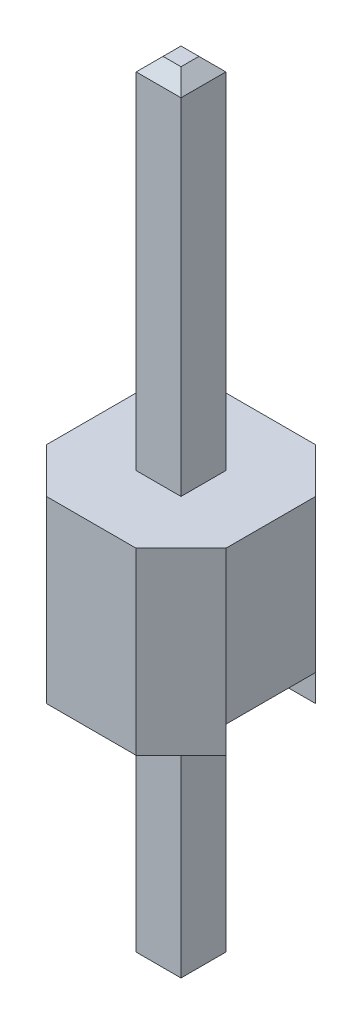
ISO-10303-21;
HEADER;
FILE_DESCRIPTION(('STEP AP214'),'2;1');
FILE_NAME('part.step','',(''),(''),'','','');
FILE_SCHEMA(('AUTOMOTIVE_DESIGN { 1 0 10303 214 1 1 1 1 }'));
ENDSEC;
DATA;
#1=APPLICATION_CONTEXT('core data for automotive mechanical design processes');
#2=APPLICATION_PROTOCOL_DEFINITION('international standard','automotive_design',2000,#1);
#3=PRODUCT_CONTEXT('',#1,'mechanical');
#4=PRODUCT('Part','Part','',(#3));
#5=PRODUCT_RELATED_PRODUCT_CATEGORY('part','',(#4));
#6=PRODUCT_DEFINITION_FORMATION('','',#4);
#7=PRODUCT_DEFINITION_CONTEXT('part definition',#1,'design');
#8=PRODUCT_DEFINITION('design','',#6,#7);
#9=PRODUCT_DEFINITION_SHAPE('','',#8);
#10=(LENGTH_UNIT() NAMED_UNIT(*) SI_UNIT(.MILLI.,.METRE.));
#11=(NAMED_UNIT(*) PLANE_ANGLE_UNIT() SI_UNIT($,.RADIAN.));
#12=(NAMED_UNIT(*) SI_UNIT($,.STERADIAN.) SOLID_ANGLE_UNIT());
#13=UNCERTAINTY_MEASURE_WITH_UNIT(LENGTH_MEASURE(1.E-05),#10,'distance_accuracy_value','');
#14=(GEOMETRIC_REPRESENTATION_CONTEXT(3) GLOBAL_UNCERTAINTY_ASSIGNED_CONTEXT((#13)) GLOBAL_UNIT_ASSIGNED_CONTEXT((#10,
#11,#12)) REPRESENTATION_CONTEXT('',''));
#15=CARTESIAN_POINT('',(0.,0.,0.));
#16=DIRECTION('',(0.,0.,1.));
#17=DIRECTION('',(1.,0.,0.));
#18=AXIS2_PLACEMENT_3D('',#15,#16,#17);
#19=CARTESIAN_POINT('',(-2.59591892663164,0.381,0.634999999999996));
#20=DIRECTION('',(0.,1.,0.));
#21=DIRECTION('',(0.,0.,1.));
#22=AXIS2_PLACEMENT_3D('',#19,#20,#21);
#23=PLANE('',#22);
#24=DIRECTION('',(0.,0.,-1.));
#25=VECTOR('',#24,1.);
#26=CARTESIAN_POINT('',(-1.27,0.381,0.635000000000008));
#27=LINE('',#26,#25);
#28=CARTESIAN_POINT('',(-1.27,0.381,0.634999999999998));
#29=VERTEX_POINT('',#28);
#30=CARTESIAN_POINT('',(-1.26999999999999,0.381,-0.635000000000004));
#31=VERTEX_POINT('',#30);
#32=EDGE_CURVE('E242',#29,#31,#27,.T.);
#33=ORIENTED_EDGE('',*,*,#32,.T.);
#34=DIRECTION('',(1.,0.,0.));
#35=VECTOR('',#34,1.);
#36=CARTESIAN_POINT('',(-2.59591892663164,0.381,-0.635000000000004));
#37=LINE('',#36,#35);
#38=CARTESIAN_POINT('',(1.27,0.381,-0.634999999999998));
#39=VERTEX_POINT('',#38);
#40=EDGE_CURVE('E250',#31,#39,#37,.T.);
#41=ORIENTED_EDGE('',*,*,#40,.T.);
#42=DIRECTION('',(0.,0.,1.));
#43=VECTOR('',#42,1.);
#44=CARTESIAN_POINT('',(1.27,0.381,0.635000000000002));
#45=LINE('',#44,#43);
#46=CARTESIAN_POINT('',(1.27,0.381,0.635000000000002));
#47=VERTEX_POINT('',#46);
#48=EDGE_CURVE('E245',#39,#47,#45,.T.);
#49=ORIENTED_EDGE('',*,*,#48,.T.);
#50=DIRECTION('',(1.,0.,0.));
#51=VECTOR('',#50,1.);
#52=CARTESIAN_POINT('',(-2.59591892663164,0.381,0.634999999999996));
#53=LINE('',#52,#51);
#54=EDGE_CURVE('E255',#29,#47,#53,.T.);
#55=ORIENTED_EDGE('',*,*,#54,.F.);
#56=EDGE_LOOP('',(#33,#41,#49,#55));
#57=FACE_BOUND('',#56,.T.);
#58=DIRECTION('',(0.,0.,1.));
#59=VECTOR('',#58,1.);
#60=CARTESIAN_POINT('',(0.3175,0.381,-0.3175));
#61=LINE('',#60,#59);
#62=CARTESIAN_POINT('',(0.3175,0.381,-0.3175));
#63=VERTEX_POINT('',#62);
#64=CARTESIAN_POINT('',(0.3175,0.381,0.3175));
#65=VERTEX_POINT('',#64);
#66=EDGE_CURVE('E187',#63,#65,#61,.T.);
#67=ORIENTED_EDGE('',*,*,#66,.F.);
#68=DIRECTION('',(1.,0.,0.));
#69=VECTOR('',#68,1.);
#70=CARTESIAN_POINT('',(-0.3175,0.381,-0.3175));
#71=LINE('',#70,#69);
#72=CARTESIAN_POINT('',(-0.3175,0.381,-0.3175));
#73=VERTEX_POINT('',#72);
#74=EDGE_CURVE('E192',#73,#63,#71,.T.);
#75=ORIENTED_EDGE('',*,*,#74,.F.);
#76=DIRECTION('',(0.,0.,-1.));
#77=VECTOR('',#76,1.);
#78=CARTESIAN_POINT('',(-0.3175,0.381,-0.3175));
#79=LINE('',#78,#77);
#80=CARTESIAN_POINT('',(-0.3175,0.381,0.3175));
#81=VERTEX_POINT('',#80);
#82=EDGE_CURVE('E204',#81,#73,#79,.T.);
#83=ORIENTED_EDGE('',*,*,#82,.F.);
#84=DIRECTION('',(-1.,0.,0.));
#85=VECTOR('',#84,1.);
#86=CARTESIAN_POINT('',(-0.3175,0.381,0.3175));
#87=LINE('',#86,#85);
#88=EDGE_CURVE('E200',#65,#81,#87,.T.);
#89=ORIENTED_EDGE('',*,*,#88,.F.);
#90=EDGE_LOOP('',(#67,#75,#83,#89));
#91=FACE_BOUND('',#90,.T.);
#92=ADVANCED_FACE('F37',(#57,#91),#23,.F.);
#93=CARTESIAN_POINT('',(0.,2.54,0.));
#94=DIRECTION('',(0.,1.,0.));
#95=DIRECTION('',(0.,0.,1.));
#96=AXIS2_PLACEMENT_3D('',#93,#94,#95);
#97=PLANE('',#96);
#98=DIRECTION('',(-1.,0.,0.));
#99=VECTOR('',#98,1.);
#100=CARTESIAN_POINT('',(-0.634999999999986,2.54,-1.27000000000001));
#101=LINE('',#100,#99);
#102=CARTESIAN_POINT('',(0.634999999999999,2.54,-1.27));
#103=VERTEX_POINT('',#102);
#104=CARTESIAN_POINT('',(-0.634999999999986,2.54,-1.27000000000001));
#105=VERTEX_POINT('',#104);
#106=EDGE_CURVE('E260',#103,#105,#101,.T.);
#107=ORIENTED_EDGE('',*,*,#106,.T.);
#108=DIRECTION('',(-0.707106781186555,0.,0.70710678118654));
#109=VECTOR('',#108,1.);
#110=CARTESIAN_POINT('',(-1.26999999999999,2.54,-0.635000000000013));
#111=LINE('',#110,#109);
#112=CARTESIAN_POINT('',(-1.26999999999999,2.54,-0.635000000000013));
#113=VERTEX_POINT('',#112);
#114=EDGE_CURVE('E263',#105,#113,#111,.T.);
#115=ORIENTED_EDGE('',*,*,#114,.T.);
#116=DIRECTION('',(0.,0.,1.));
#117=VECTOR('',#116,1.);
#118=CARTESIAN_POINT('',(-1.27,2.54,0.63499999999999));
#119=LINE('',#118,#117);
#120=CARTESIAN_POINT('',(-1.27,2.54,0.63499999999999));
#121=VERTEX_POINT('',#120);
#122=EDGE_CURVE('E266',#113,#121,#119,.T.);
#123=ORIENTED_EDGE('',*,*,#122,.T.);
#124=DIRECTION('',(0.707106781186542,0.,0.707106781186553));
#125=VECTOR('',#124,1.);
#126=CARTESIAN_POINT('',(-0.635000000000008,2.54,1.27));
#127=LINE('',#126,#125);
#128=CARTESIAN_POINT('',(-0.635000000000008,2.54,1.27));
#129=VERTEX_POINT('',#128);
#130=EDGE_CURVE('E268',#121,#129,#127,.T.);
#131=ORIENTED_EDGE('',*,*,#130,.T.);
#132=DIRECTION('',(1.,0.,0.));
#133=VECTOR('',#132,1.);
#134=CARTESIAN_POINT('',(-0.635000000000008,2.54,1.27));
#135=LINE('',#134,#133);
#136=CARTESIAN_POINT('',(0.634999999999995,2.54,1.27));
#137=VERTEX_POINT('',#136);
#138=EDGE_CURVE('E270',#129,#137,#135,.T.);
#139=ORIENTED_EDGE('',*,*,#138,.T.);
#140=DIRECTION('',(0.70710678118655,0.,-0.707106781186545));
#141=VECTOR('',#140,1.);
#142=CARTESIAN_POINT('',(1.27,2.54,0.635000000000004));
#143=LINE('',#142,#141);
#144=CARTESIAN_POINT('',(1.27,2.54,0.635000000000004));
#145=VERTEX_POINT('',#144);
#146=EDGE_CURVE('E272',#137,#145,#143,.T.);
#147=ORIENTED_EDGE('',*,*,#146,.T.);
#148=DIRECTION('',(0.,0.,-1.));
#149=VECTOR('',#148,1.);
#150=CARTESIAN_POINT('',(1.27,2.54,0.635000000000004));
#151=LINE('',#150,#149);
#152=CARTESIAN_POINT('',(1.27,2.54,-0.634999999999999));
#153=VERTEX_POINT('',#152);
#154=EDGE_CURVE('E274',#145,#153,#151,.T.);
#155=ORIENTED_EDGE('',*,*,#154,.T.);
#156=DIRECTION('',(-0.707106781186548,0.,-0.707106781186548));
#157=VECTOR('',#156,1.);
#158=CARTESIAN_POINT('',(0.634999999999999,2.54,-1.27));
#159=LINE('',#158,#157);
#160=EDGE_CURVE('E276',#153,#103,#159,.T.);
#161=ORIENTED_EDGE('',*,*,#160,.T.);
#162=EDGE_LOOP('',(#107,#115,#123,#131,#139,#147,#155,#161));
#163=FACE_BOUND('',#162,.T.);
#164=DIRECTION('',(-1.,0.,0.));
#165=VECTOR('',#164,1.);
#166=CARTESIAN_POINT('',(-0.3175,2.54,-0.3175));
#167=LINE('',#166,#165);
#168=CARTESIAN_POINT('',(0.3175,2.54,-0.3175));
#169=VERTEX_POINT('',#168);
#170=CARTESIAN_POINT('',(-0.3175,2.54,-0.3175));
#171=VERTEX_POINT('',#170);
#172=EDGE_CURVE('E218',#169,#171,#167,.T.);
#173=ORIENTED_EDGE('',*,*,#172,.F.);
#174=DIRECTION('',(0.,0.,-1.));
#175=VECTOR('',#174,1.);
#176=CARTESIAN_POINT('',(0.3175,2.54,0.3175));
#177=LINE('',#176,#175);
#178=CARTESIAN_POINT('',(0.3175,2.54,0.3175));
#179=VERTEX_POINT('',#178);
#180=EDGE_CURVE('E215',#179,#169,#177,.T.);
#181=ORIENTED_EDGE('',*,*,#180,.F.);
#182=DIRECTION('',(1.,0.,0.));
#183=VECTOR('',#182,1.);
#184=CARTESIAN_POINT('',(-0.3175,2.54,0.3175));
#185=LINE('',#184,#183);
#186=CARTESIAN_POINT('',(-0.3175,2.54,0.3175));
#187=VERTEX_POINT('',#186);
#188=EDGE_CURVE('E225',#187,#179,#185,.T.);
#189=ORIENTED_EDGE('',*,*,#188,.F.);
#190=DIRECTION('',(0.,0.,1.));
#191=VECTOR('',#190,1.);
#192=CARTESIAN_POINT('',(-0.3175,2.54,0.3175));
#193=LINE('',#192,#191);
#194=EDGE_CURVE('E222',#171,#187,#193,.T.);
#195=ORIENTED_EDGE('',*,*,#194,.F.);
#196=EDGE_LOOP('',(#173,#181,#189,#195));
#197=FACE_BOUND('',#196,.T.);
#198=ADVANCED_FACE('F390',(#163,#197),#97,.T.);
#199=CARTESIAN_POINT('',(0.,0.,0.));
#200=DIRECTION('',(0.,1.,0.));
#201=DIRECTION('',(0.,0.,1.));
#202=AXIS2_PLACEMENT_3D('',#199,#200,#201);
#203=PLANE('',#202);
#204=DIRECTION('',(-0.707106781186548,0.,-0.707106781186548));
#205=VECTOR('',#204,1.);
#206=CARTESIAN_POINT('',(0.634999999999999,0.,-1.27));
#207=LINE('',#206,#205);
#208=CARTESIAN_POINT('',(1.27,0.,-0.634999999999999));
#209=VERTEX_POINT('',#208);
#210=CARTESIAN_POINT('',(0.634999999999999,0.,-1.27));
#211=VERTEX_POINT('',#210);
#212=EDGE_CURVE('E264',#209,#211,#207,.T.);
#213=ORIENTED_EDGE('',*,*,#212,.F.);
#214=DIRECTION('',(1.,0.,0.));
#215=VECTOR('',#214,1.);
#216=CARTESIAN_POINT('',(-2.59591892663164,0.,-0.635000000000005));
#217=LINE('',#216,#215);
#218=CARTESIAN_POINT('',(-1.26999999999999,0.,-0.635000000000006));
#219=VERTEX_POINT('',#218);
#220=EDGE_CURVE('E240',#219,#209,#217,.T.);
#221=ORIENTED_EDGE('',*,*,#220,.F.);
#222=DIRECTION('',(-0.707106781186555,0.,0.70710678118654));
#223=VECTOR('',#222,1.);
#224=CARTESIAN_POINT('',(-1.26999999999999,0.,-0.635000000000013));
#225=LINE('',#224,#223);
#226=CARTESIAN_POINT('',(-0.634999999999986,0.,-1.27000000000001));
#227=VERTEX_POINT('',#226);
#228=EDGE_CURVE('E281',#227,#219,#225,.T.);
#229=ORIENTED_EDGE('',*,*,#228,.F.);
#230=DIRECTION('',(-1.,0.,0.));
#231=VECTOR('',#230,1.);
#232=CARTESIAN_POINT('',(-0.634999999999986,0.,-1.27000000000001));
#233=LINE('',#232,#231);
#234=EDGE_CURVE('E259',#211,#227,#233,.T.);
#235=ORIENTED_EDGE('',*,*,#234,.F.);
#236=EDGE_LOOP('',(#213,#221,#229,#235));
#237=FACE_BOUND('',#236,.T.);
#238=ADVANCED_FACE('F396',(#237),#203,.F.);
#239=CARTESIAN_POINT('',(-0.634999999999986,2.54,-1.27000000000001));
#240=DIRECTION('',(0.,0.,1.));
#241=DIRECTION('',(1.,0.,0.));
#242=AXIS2_PLACEMENT_3D('',#239,#240,#241);
#243=PLANE('',#242);
#244=ORIENTED_EDGE('',*,*,#234,.T.);
#245=DIRECTION('',(0.,-1.,0.));
#246=VECTOR('',#245,1.);
#247=CARTESIAN_POINT('',(-0.634999999999986,2.54,-1.27000000000001));
#248=LINE('',#247,#246);
#249=EDGE_CURVE('E312',#105,#227,#248,.T.);
#250=ORIENTED_EDGE('',*,*,#249,.F.);
#251=ORIENTED_EDGE('',*,*,#106,.F.);
#252=DIRECTION('',(0.,-1.,0.));
#253=VECTOR('',#252,1.);
#254=CARTESIAN_POINT('',(0.634999999999999,2.54,-1.27));
#255=LINE('',#254,#253);
#256=EDGE_CURVE('E278',#103,#211,#255,.T.);
#257=ORIENTED_EDGE('',*,*,#256,.T.);
#258=EDGE_LOOP('',(#244,#250,#251,#257));
#259=FACE_BOUND('',#258,.T.);
#260=ADVANCED_FACE('F438',(#259),#243,.F.);
#261=CARTESIAN_POINT('',(-1.26999999999999,2.54,-0.635000000000013));
#262=DIRECTION('',(0.70710678118654,0.,0.707106781186555));
#263=DIRECTION('',(0.707106781186555,0.,-0.70710678118654));
#264=AXIS2_PLACEMENT_3D('',#261,#262,#263);
#265=PLANE('',#264);
#266=ORIENTED_EDGE('',*,*,#228,.T.);
#267=DIRECTION('',(0.,-1.,0.));
#268=VECTOR('',#267,1.);
#269=CARTESIAN_POINT('',(-1.26999999999999,0.,-0.635000000000003));
#270=LINE('',#269,#268);
#271=EDGE_CURVE('E239',#31,#219,#270,.T.);
#272=ORIENTED_EDGE('',*,*,#271,.F.);
#273=DIRECTION('',(0.,-1.,0.));
#274=VECTOR('',#273,1.);
#275=CARTESIAN_POINT('',(-1.26999999999999,2.54,-0.635000000000013));
#276=LINE('',#275,#274);
#277=EDGE_CURVE('E309',#113,#31,#276,.T.);
#278=ORIENTED_EDGE('',*,*,#277,.F.);
#279=ORIENTED_EDGE('',*,*,#114,.F.);
#280=ORIENTED_EDGE('',*,*,#249,.T.);
#281=EDGE_LOOP('',(#266,#272,#278,#279,#280));
#282=FACE_BOUND('',#281,.T.);
#283=ADVANCED_FACE('F434',(#282),#265,.F.);
#284=CARTESIAN_POINT('',(-1.27,2.54,0.63499999999999));
#285=DIRECTION('',(1.,0.,0.));
#286=DIRECTION('',(0.,0.,-1.));
#287=AXIS2_PLACEMENT_3D('',#284,#285,#286);
#288=PLANE('',#287);
#289=ORIENTED_EDGE('',*,*,#277,.T.);
#290=ORIENTED_EDGE('',*,*,#32,.F.);
#291=DIRECTION('',(0.,-1.,0.));
#292=VECTOR('',#291,1.);
#293=CARTESIAN_POINT('',(-1.27,2.54,0.63499999999999));
#294=LINE('',#293,#292);
#295=EDGE_CURVE('E306',#121,#29,#294,.T.);
#296=ORIENTED_EDGE('',*,*,#295,.F.);
#297=ORIENTED_EDGE('',*,*,#122,.F.);
#298=EDGE_LOOP('',(#289,#290,#296,#297));
#299=FACE_BOUND('',#298,.T.);
#300=ADVANCED_FACE('F430',(#299),#288,.F.);
#301=CARTESIAN_POINT('',(-0.635000000000008,2.54,1.27));
#302=DIRECTION('',(0.707106781186553,0.,-0.707106781186542));
#303=DIRECTION('',(-0.707106781186542,0.,-0.707106781186553));
#304=AXIS2_PLACEMENT_3D('',#301,#302,#303);
#305=PLANE('',#304);
#306=DIRECTION('',(0.707106781186542,0.,0.707106781186553));
#307=VECTOR('',#306,1.);
#308=CARTESIAN_POINT('',(-0.635000000000008,0.,1.27));
#309=LINE('',#308,#307);
#310=CARTESIAN_POINT('',(-1.27,0.,0.635));
#311=VERTEX_POINT('',#310);
#312=CARTESIAN_POINT('',(-0.635000000000008,0.,1.27));
#313=VERTEX_POINT('',#312);
#314=EDGE_CURVE('E284',#311,#313,#309,.T.);
#315=ORIENTED_EDGE('',*,*,#314,.T.);
#316=DIRECTION('',(0.,-1.,0.));
#317=VECTOR('',#316,1.);
#318=CARTESIAN_POINT('',(-0.635000000000008,2.54,1.27));
#319=LINE('',#318,#317);
#320=EDGE_CURVE('E303',#129,#313,#319,.T.);
#321=ORIENTED_EDGE('',*,*,#320,.F.);
#322=ORIENTED_EDGE('',*,*,#130,.F.);
#323=ORIENTED_EDGE('',*,*,#295,.T.);
#324=DIRECTION('',(0.,1.,0.));
#325=VECTOR('',#324,1.);
#326=CARTESIAN_POINT('',(-1.27,0.,0.635));
#327=LINE('',#326,#325);
#328=EDGE_CURVE('E237',#311,#29,#327,.T.);
#329=ORIENTED_EDGE('',*,*,#328,.F.);
#330=EDGE_LOOP('',(#315,#321,#322,#323,#329));
#331=FACE_BOUND('',#330,.T.);
#332=ADVANCED_FACE('F426',(#331),#305,.F.);
#333=CARTESIAN_POINT('',(-0.635000000000008,2.54,1.27));
#334=DIRECTION('',(0.,0.,-1.));
#335=DIRECTION('',(-1.,0.,0.));
#336=AXIS2_PLACEMENT_3D('',#333,#334,#335);
#337=PLANE('',#336);
#338=DIRECTION('',(1.,0.,0.));
#339=VECTOR('',#338,1.);
#340=CARTESIAN_POINT('',(-0.635000000000008,0.,1.27));
#341=LINE('',#340,#339);
#342=CARTESIAN_POINT('',(0.634999999999995,0.,1.27));
#343=VERTEX_POINT('',#342);
#344=EDGE_CURVE('E286',#313,#343,#341,.T.);
#345=ORIENTED_EDGE('',*,*,#344,.T.);
#346=DIRECTION('',(0.,-1.,0.));
#347=VECTOR('',#346,1.);
#348=CARTESIAN_POINT('',(0.634999999999995,2.54,1.27));
#349=LINE('',#348,#347);
#350=EDGE_CURVE('E300',#137,#343,#349,.T.);
#351=ORIENTED_EDGE('',*,*,#350,.F.);
#352=ORIENTED_EDGE('',*,*,#138,.F.);
#353=ORIENTED_EDGE('',*,*,#320,.T.);
#354=EDGE_LOOP('',(#345,#351,#352,#353));
#355=FACE_BOUND('',#354,.T.);
#356=ADVANCED_FACE('F422',(#355),#337,.F.);
#357=CARTESIAN_POINT('',(1.27,2.54,0.635000000000004));
#358=DIRECTION('',(-0.707106781186545,0.,-0.70710678118655));
#359=DIRECTION('',(-0.70710678118655,0.,0.707106781186545));
#360=AXIS2_PLACEMENT_3D('',#357,#358,#359);
#361=PLANE('',#360);
#362=DIRECTION('',(0.70710678118655,0.,-0.707106781186545));
#363=VECTOR('',#362,1.);
#364=CARTESIAN_POINT('',(1.27,0.,0.635000000000004));
#365=LINE('',#364,#363);
#366=CARTESIAN_POINT('',(1.27,0.,0.635000000000004));
#367=VERTEX_POINT('',#366);
#368=EDGE_CURVE('E288',#343,#367,#365,.T.);
#369=ORIENTED_EDGE('',*,*,#368,.T.);
#370=DIRECTION('',(0.,-1.,0.));
#371=VECTOR('',#370,1.);
#372=CARTESIAN_POINT('',(1.27,0.,0.635000000000004));
#373=LINE('',#372,#371);
#374=EDGE_CURVE('E248',#47,#367,#373,.T.);
#375=ORIENTED_EDGE('',*,*,#374,.F.);
#376=DIRECTION('',(0.,-1.,0.));
#377=VECTOR('',#376,1.);
#378=CARTESIAN_POINT('',(1.27,2.54,0.635000000000004));
#379=LINE('',#378,#377);
#380=EDGE_CURVE('E297',#145,#47,#379,.T.);
#381=ORIENTED_EDGE('',*,*,#380,.F.);
#382=ORIENTED_EDGE('',*,*,#146,.F.);
#383=ORIENTED_EDGE('',*,*,#350,.T.);
#384=EDGE_LOOP('',(#369,#375,#381,#382,#383));
#385=FACE_BOUND('',#384,.T.);
#386=ADVANCED_FACE('F418',(#385),#361,.F.);
#387=CARTESIAN_POINT('',(1.27,2.54,0.635000000000004));
#388=DIRECTION('',(-1.,0.,0.));
#389=DIRECTION('',(0.,0.,1.));
#390=AXIS2_PLACEMENT_3D('',#387,#388,#389);
#391=PLANE('',#390);
#392=ORIENTED_EDGE('',*,*,#380,.T.);
#393=ORIENTED_EDGE('',*,*,#48,.F.);
#394=DIRECTION('',(0.,-1.,0.));
#395=VECTOR('',#394,1.);
#396=CARTESIAN_POINT('',(1.27,2.54,-0.634999999999999));
#397=LINE('',#396,#395);
#398=EDGE_CURVE('E294',#153,#39,#397,.T.);
#399=ORIENTED_EDGE('',*,*,#398,.F.);
#400=ORIENTED_EDGE('',*,*,#154,.F.);
#401=EDGE_LOOP('',(#392,#393,#399,#400));
#402=FACE_BOUND('',#401,.T.);
#403=ADVANCED_FACE('F414',(#402),#391,.F.);
#404=CARTESIAN_POINT('',(0.634999999999999,2.54,-1.27));
#405=DIRECTION('',(-0.707106781186548,0.,0.707106781186548));
#406=DIRECTION('',(0.707106781186548,0.,0.707106781186548));
#407=AXIS2_PLACEMENT_3D('',#404,#405,#406);
#408=PLANE('',#407);
#409=ORIENTED_EDGE('',*,*,#212,.T.);
#410=ORIENTED_EDGE('',*,*,#256,.F.);
#411=ORIENTED_EDGE('',*,*,#160,.F.);
#412=ORIENTED_EDGE('',*,*,#398,.T.);
#413=DIRECTION('',(0.,1.,0.));
#414=VECTOR('',#413,1.);
#415=CARTESIAN_POINT('',(1.27,0.,-0.634999999999999));
#416=LINE('',#415,#414);
#417=EDGE_CURVE('E236',#209,#39,#416,.T.);
#418=ORIENTED_EDGE('',*,*,#417,.F.);
#419=EDGE_LOOP('',(#409,#410,#411,#412,#418));
#420=FACE_BOUND('',#419,.T.);
#421=ADVANCED_FACE('F410',(#420),#408,.F.);
#422=ORIENTED_EDGE('',*,*,#314,.F.);
#423=DIRECTION('',(1.,0.,0.));
#424=VECTOR('',#423,1.);
#425=CARTESIAN_POINT('',(-2.59591892663164,0.,0.634999999999998));
#426=LINE('',#425,#424);
#427=EDGE_CURVE('E252',#311,#367,#426,.T.);
#428=ORIENTED_EDGE('',*,*,#427,.T.);
#429=ORIENTED_EDGE('',*,*,#368,.F.);
#430=ORIENTED_EDGE('',*,*,#344,.F.);
#431=EDGE_LOOP('',(#422,#428,#429,#430));
#432=FACE_BOUND('',#431,.T.);
#433=ADVANCED_FACE('F405',(#432),#203,.F.);
#434=CARTESIAN_POINT('',(-2.59591892663164,0.,-0.635000000000005));
#435=DIRECTION('',(0.,0.,-1.));
#436=DIRECTION('',(0.,1.,0.));
#437=AXIS2_PLACEMENT_3D('',#434,#435,#436);
#438=PLANE('',#437);
#439=ORIENTED_EDGE('',*,*,#271,.T.);
#440=ORIENTED_EDGE('',*,*,#220,.T.);
#441=ORIENTED_EDGE('',*,*,#417,.T.);
#442=ORIENTED_EDGE('',*,*,#40,.F.);
#443=EDGE_LOOP('',(#439,#440,#441,#442));
#444=FACE_BOUND('',#443,.T.);
#445=ADVANCED_FACE('F403',(#444),#438,.F.);
#446=CARTESIAN_POINT('',(-2.59591892663164,0.,0.634999999999998));
#447=DIRECTION('',(0.,0.,1.));
#448=DIRECTION('',(0.,-1.,0.));
#449=AXIS2_PLACEMENT_3D('',#446,#447,#448);
#450=PLANE('',#449);
#451=ORIENTED_EDGE('',*,*,#328,.T.);
#452=ORIENTED_EDGE('',*,*,#54,.T.);
#453=ORIENTED_EDGE('',*,*,#374,.T.);
#454=ORIENTED_EDGE('',*,*,#427,.F.);
#455=EDGE_LOOP('',(#451,#452,#453,#454));
#456=FACE_BOUND('',#455,.T.);
#457=ADVANCED_FACE('F401',(#456),#450,.F.);
#458=CARTESIAN_POINT('',(0.3175,7.62,0.3175));
#459=DIRECTION('',(-1.,0.,0.));
#460=DIRECTION('',(0.,0.,1.));
#461=AXIS2_PLACEMENT_3D('',#458,#459,#460);
#462=PLANE('',#461);
#463=DIRECTION('',(0.,-1.,0.));
#464=VECTOR('',#463,1.);
#465=CARTESIAN_POINT('',(0.3175,7.62,-0.3175));
#466=LINE('',#465,#464);
#467=CARTESIAN_POINT('',(0.3175,7.4295,-0.3175));
#468=VERTEX_POINT('',#467);
#469=EDGE_CURVE('E234',#468,#169,#466,.T.);
#470=ORIENTED_EDGE('',*,*,#469,.F.);
#471=DIRECTION('',(0.,0.,1.));
#472=VECTOR('',#471,1.);
#473=CARTESIAN_POINT('',(0.3175,7.4295,0.3175));
#474=LINE('',#473,#472);
#475=CARTESIAN_POINT('',(0.3175,7.4295,0.3175));
#476=VERTEX_POINT('',#475);
#477=EDGE_CURVE('E327',#468,#476,#474,.T.);
#478=ORIENTED_EDGE('',*,*,#477,.T.);
#479=DIRECTION('',(0.,-1.,0.));
#480=VECTOR('',#479,1.);
#481=CARTESIAN_POINT('',(0.3175,7.62,0.3175));
#482=LINE('',#481,#480);
#483=EDGE_CURVE('E228',#476,#179,#482,.T.);
#484=ORIENTED_EDGE('',*,*,#483,.T.);
#485=ORIENTED_EDGE('',*,*,#180,.T.);
#486=EDGE_LOOP('',(#470,#478,#484,#485));
#487=FACE_BOUND('',#486,.T.);
#488=ADVANCED_FACE('F527',(#487),#462,.F.);
#489=CARTESIAN_POINT('',(-0.3175,7.62,-0.3175));
#490=DIRECTION('',(0.,0.,1.));
#491=DIRECTION('',(1.,0.,0.));
#492=AXIS2_PLACEMENT_3D('',#489,#490,#491);
#493=PLANE('',#492);
#494=DIRECTION('',(0.,-1.,0.));
#495=VECTOR('',#494,1.);
#496=CARTESIAN_POINT('',(-0.3175,7.62,-0.3175));
#497=LINE('',#496,#495);
#498=CARTESIAN_POINT('',(-0.3175,7.4295,-0.3175));
#499=VERTEX_POINT('',#498);
#500=EDGE_CURVE('E232',#499,#171,#497,.T.);
#501=ORIENTED_EDGE('',*,*,#500,.F.);
#502=DIRECTION('',(1.,0.,0.));
#503=VECTOR('',#502,1.);
#504=CARTESIAN_POINT('',(-0.3175,7.4295,-0.3175));
#505=LINE('',#504,#503);
#506=EDGE_CURVE('E324',#499,#468,#505,.T.);
#507=ORIENTED_EDGE('',*,*,#506,.T.);
#508=ORIENTED_EDGE('',*,*,#469,.T.);
#509=ORIENTED_EDGE('',*,*,#172,.T.);
#510=EDGE_LOOP('',(#501,#507,#508,#509));
#511=FACE_BOUND('',#510,.T.);
#512=ADVANCED_FACE('F515',(#511),#493,.F.);
#513=CARTESIAN_POINT('',(-0.3175,7.62,0.3175));
#514=DIRECTION('',(1.,0.,0.));
#515=DIRECTION('',(0.,0.,-1.));
#516=AXIS2_PLACEMENT_3D('',#513,#514,#515);
#517=PLANE('',#516);
#518=DIRECTION('',(0.,-1.,0.));
#519=VECTOR('',#518,1.);
#520=CARTESIAN_POINT('',(-0.3175,7.62,0.3175));
#521=LINE('',#520,#519);
#522=CARTESIAN_POINT('',(-0.3175,7.4295,0.3175));
#523=VERTEX_POINT('',#522);
#524=EDGE_CURVE('E230',#523,#187,#521,.T.);
#525=ORIENTED_EDGE('',*,*,#524,.F.);
#526=DIRECTION('',(0.,0.,-1.));
#527=VECTOR('',#526,1.);
#528=CARTESIAN_POINT('',(-0.3175,7.4295,0.3175));
#529=LINE('',#528,#527);
#530=EDGE_CURVE('E329',#523,#499,#529,.T.);
#531=ORIENTED_EDGE('',*,*,#530,.T.);
#532=ORIENTED_EDGE('',*,*,#500,.T.);
#533=ORIENTED_EDGE('',*,*,#194,.T.);
#534=EDGE_LOOP('',(#525,#531,#532,#533));
#535=FACE_BOUND('',#534,.T.);
#536=ADVANCED_FACE('F509',(#535),#517,.F.);
#537=CARTESIAN_POINT('',(-0.3175,7.62,0.3175));
#538=DIRECTION('',(0.,0.,-1.));
#539=DIRECTION('',(-1.,0.,0.));
#540=AXIS2_PLACEMENT_3D('',#537,#538,#539);
#541=PLANE('',#540);
#542=ORIENTED_EDGE('',*,*,#483,.F.);
#543=DIRECTION('',(-1.,0.,0.));
#544=VECTOR('',#543,1.);
#545=CARTESIAN_POINT('',(-0.3175,7.4295,0.3175));
#546=LINE('',#545,#544);
#547=EDGE_CURVE('E331',#476,#523,#546,.T.);
#548=ORIENTED_EDGE('',*,*,#547,.T.);
#549=ORIENTED_EDGE('',*,*,#524,.T.);
#550=ORIENTED_EDGE('',*,*,#188,.T.);
#551=EDGE_LOOP('',(#542,#548,#549,#550));
#552=FACE_BOUND('',#551,.T.);
#553=ADVANCED_FACE('F514',(#552),#541,.F.);
#554=CARTESIAN_POINT('',(0.,7.62,0.));
#555=DIRECTION('',(0.,-1.,0.));
#556=DIRECTION('',(0.,0.,-1.));
#557=AXIS2_PLACEMENT_3D('',#554,#555,#556);
#558=PLANE('',#557);
#559=DIRECTION('',(0.,0.,-1.));
#560=VECTOR('',#559,1.);
#561=CARTESIAN_POINT('',(0.127000000000001,7.62,0.));
#562=LINE('',#561,#560);
#563=CARTESIAN_POINT('',(0.127000000000001,7.62,0.127000000000001));
#564=VERTEX_POINT('',#563);
#565=CARTESIAN_POINT('',(0.127000000000001,7.62,-0.127000000000001));
#566=VERTEX_POINT('',#565);
#567=EDGE_CURVE('E319',#564,#566,#562,.T.);
#568=ORIENTED_EDGE('',*,*,#567,.T.);
#569=DIRECTION('',(-1.,0.,0.));
#570=VECTOR('',#569,1.);
#571=CARTESIAN_POINT('',(0.,7.62,-0.127000000000001));
#572=LINE('',#571,#570);
#573=CARTESIAN_POINT('',(-0.127000000000001,7.62,-0.127000000000001));
#574=VERTEX_POINT('',#573);
#575=EDGE_CURVE('E321',#566,#574,#572,.T.);
#576=ORIENTED_EDGE('',*,*,#575,.T.);
#577=DIRECTION('',(0.,0.,1.));
#578=VECTOR('',#577,1.);
#579=CARTESIAN_POINT('',(-0.127000000000001,7.62,0.));
#580=LINE('',#579,#578);
#581=CARTESIAN_POINT('',(-0.127000000000001,7.62,0.127000000000001));
#582=VERTEX_POINT('',#581);
#583=EDGE_CURVE('E317',#574,#582,#580,.T.);
#584=ORIENTED_EDGE('',*,*,#583,.T.);
#585=DIRECTION('',(1.,0.,0.));
#586=VECTOR('',#585,1.);
#587=CARTESIAN_POINT('',(0.,7.62,0.127000000000001));
#588=LINE('',#587,#586);
#589=EDGE_CURVE('E315',#582,#564,#588,.T.);
#590=ORIENTED_EDGE('',*,*,#589,.T.);
#591=EDGE_LOOP('',(#568,#576,#584,#590));
#592=FACE_BOUND('',#591,.T.);
#593=ADVANCED_FACE('F458',(#592),#558,.F.);
#594=CARTESIAN_POINT('',(0.,7.62,0.127000000000001));
#595=DIRECTION('',(0.,-0.707106781186546,-0.707106781186549));
#596=DIRECTION('',(1.,0.,0.));
#597=AXIS2_PLACEMENT_3D('',#594,#595,#596);
#598=PLANE('',#597);
#599=DIRECTION('',(-0.577350269189625,-0.577350269189628,0.577350269189625));
#600=VECTOR('',#599,1.);
#601=CARTESIAN_POINT('',(-0.0846666666666676,7.66233333333333,0.0846666666666676));
#602=LINE('',#601,#600);
#603=EDGE_CURVE('E337',#523,#582,#602,.F.);
#604=ORIENTED_EDGE('',*,*,#603,.F.);
#605=ORIENTED_EDGE('',*,*,#547,.F.);
#606=DIRECTION('',(-0.577350269189625,0.577350269189628,-0.577350269189625));
#607=VECTOR('',#606,1.);
#608=CARTESIAN_POINT('',(0.0846666666666676,7.66233333333333,0.0846666666666676));
#609=LINE('',#608,#607);
#610=EDGE_CURVE('E219',#564,#476,#609,.F.);
#611=ORIENTED_EDGE('',*,*,#610,.F.);
#612=ORIENTED_EDGE('',*,*,#589,.F.);
#613=EDGE_LOOP('',(#604,#605,#611,#612));
#614=FACE_BOUND('',#613,.T.);
#615=ADVANCED_FACE('F454',(#614),#598,.F.);
#616=CARTESIAN_POINT('',(0.127000000000001,7.62,0.));
#617=DIRECTION('',(-0.707106781186549,-0.707106781186546,0.));
#618=DIRECTION('',(0.,0.,-1.));
#619=AXIS2_PLACEMENT_3D('',#616,#617,#618);
#620=PLANE('',#619);
#621=ORIENTED_EDGE('',*,*,#610,.T.);
#622=ORIENTED_EDGE('',*,*,#477,.F.);
#623=DIRECTION('',(-0.577350269189625,0.577350269189628,0.577350269189625));
#624=VECTOR('',#623,1.);
#625=CARTESIAN_POINT('',(0.0846666666666676,7.66233333333333,-0.0846666666666676));
#626=LINE('',#625,#624);
#627=EDGE_CURVE('E335',#566,#468,#626,.F.);
#628=ORIENTED_EDGE('',*,*,#627,.F.);
#629=ORIENTED_EDGE('',*,*,#567,.F.);
#630=EDGE_LOOP('',(#621,#622,#628,#629));
#631=FACE_BOUND('',#630,.T.);
#632=ADVANCED_FACE('F450',(#631),#620,.F.);
#633=CARTESIAN_POINT('',(-0.127000000000001,7.62,0.));
#634=DIRECTION('',(0.707106781186549,-0.707106781186546,0.));
#635=DIRECTION('',(0.,0.,1.));
#636=AXIS2_PLACEMENT_3D('',#633,#634,#635);
#637=PLANE('',#636);
#638=ORIENTED_EDGE('',*,*,#603,.T.);
#639=ORIENTED_EDGE('',*,*,#583,.F.);
#640=DIRECTION('',(-0.577350269189625,-0.577350269189628,-0.577350269189625));
#641=VECTOR('',#640,1.);
#642=CARTESIAN_POINT('',(-0.0846666666666676,7.66233333333333,-0.0846666666666676));
#643=LINE('',#642,#641);
#644=EDGE_CURVE('E214',#499,#574,#643,.F.);
#645=ORIENTED_EDGE('',*,*,#644,.F.);
#646=ORIENTED_EDGE('',*,*,#530,.F.);
#647=EDGE_LOOP('',(#638,#639,#645,#646));
#648=FACE_BOUND('',#647,.T.);
#649=ADVANCED_FACE('F446',(#648),#637,.F.);
#650=CARTESIAN_POINT('',(0.,7.62,-0.127000000000001));
#651=DIRECTION('',(0.,-0.707106781186546,0.707106781186549));
#652=DIRECTION('',(-1.,0.,0.));
#653=AXIS2_PLACEMENT_3D('',#650,#651,#652);
#654=PLANE('',#653);
#655=ORIENTED_EDGE('',*,*,#627,.T.);
#656=ORIENTED_EDGE('',*,*,#506,.F.);
#657=ORIENTED_EDGE('',*,*,#644,.T.);
#658=ORIENTED_EDGE('',*,*,#575,.F.);
#659=EDGE_LOOP('',(#655,#656,#657,#658));
#660=FACE_BOUND('',#659,.T.);
#661=ADVANCED_FACE('F443',(#660),#654,.F.);
#662=CARTESIAN_POINT('',(0.3175,-3.556,-0.3175));
#663=DIRECTION('',(-1.,0.,0.));
#664=DIRECTION('',(0.,0.,1.));
#665=AXIS2_PLACEMENT_3D('',#662,#663,#664);
#666=PLANE('',#665);
#667=DIRECTION('',(0.,1.,0.));
#668=VECTOR('',#667,1.);
#669=CARTESIAN_POINT('',(0.3175,-3.556,0.3175));
#670=LINE('',#669,#668);
#671=CARTESIAN_POINT('',(0.3175,-3.3655,0.3175));
#672=VERTEX_POINT('',#671);
#673=EDGE_CURVE('E212',#672,#65,#670,.T.);
#674=ORIENTED_EDGE('',*,*,#673,.F.);
#675=DIRECTION('',(0.,0.,-1.));
#676=VECTOR('',#675,1.);
#677=CARTESIAN_POINT('',(0.3175,-3.3655,-0.3175));
#678=LINE('',#677,#676);
#679=CARTESIAN_POINT('',(0.3175,-3.3655,-0.3175));
#680=VERTEX_POINT('',#679);
#681=EDGE_CURVE('E46',#672,#680,#678,.T.);
#682=ORIENTED_EDGE('',*,*,#681,.T.);
#683=DIRECTION('',(0.,1.,0.));
#684=VECTOR('',#683,1.);
#685=CARTESIAN_POINT('',(0.3175,-3.556,-0.3175));
#686=LINE('',#685,#684);
#687=EDGE_CURVE('E184',#680,#63,#686,.T.);
#688=ORIENTED_EDGE('',*,*,#687,.T.);
#689=ORIENTED_EDGE('',*,*,#66,.T.);
#690=EDGE_LOOP('',(#674,#682,#688,#689));
#691=FACE_BOUND('',#690,.T.);
#692=ADVANCED_FACE('F186',(#691),#666,.F.);
#693=CARTESIAN_POINT('',(-0.3175,-3.556,0.3175));
#694=DIRECTION('',(0.,0.,-1.));
#695=DIRECTION('',(-1.,0.,0.));
#696=AXIS2_PLACEMENT_3D('',#693,#694,#695);
#697=PLANE('',#696);
#698=DIRECTION('',(0.,1.,0.));
#699=VECTOR('',#698,1.);
#700=CARTESIAN_POINT('',(-0.3175,-3.556,0.3175));
#701=LINE('',#700,#699);
#702=CARTESIAN_POINT('',(-0.3175,-3.3655,0.3175));
#703=VERTEX_POINT('',#702);
#704=EDGE_CURVE('E210',#703,#81,#701,.T.);
#705=ORIENTED_EDGE('',*,*,#704,.F.);
#706=DIRECTION('',(1.,0.,0.));
#707=VECTOR('',#706,1.);
#708=CARTESIAN_POINT('',(-0.3175,-3.3655,0.3175));
#709=LINE('',#708,#707);
#710=EDGE_CURVE('E11',#703,#672,#709,.T.);
#711=ORIENTED_EDGE('',*,*,#710,.T.);
#712=ORIENTED_EDGE('',*,*,#673,.T.);
#713=ORIENTED_EDGE('',*,*,#88,.T.);
#714=EDGE_LOOP('',(#705,#711,#712,#713));
#715=FACE_BOUND('',#714,.T.);
#716=ADVANCED_FACE('F486',(#715),#697,.F.);
#717=CARTESIAN_POINT('',(-0.3175,-3.556,-0.3175));
#718=DIRECTION('',(1.,0.,0.));
#719=DIRECTION('',(0.,0.,-1.));
#720=AXIS2_PLACEMENT_3D('',#717,#718,#719);
#721=PLANE('',#720);
#722=DIRECTION('',(0.,1.,0.));
#723=VECTOR('',#722,1.);
#724=CARTESIAN_POINT('',(-0.3175,-3.556,-0.3175));
#725=LINE('',#724,#723);
#726=CARTESIAN_POINT('',(-0.3175,-3.3655,-0.3175));
#727=VERTEX_POINT('',#726);
#728=EDGE_CURVE('E191',#727,#73,#725,.T.);
#729=ORIENTED_EDGE('',*,*,#728,.F.);
#730=DIRECTION('',(0.,0.,1.));
#731=VECTOR('',#730,1.);
#732=CARTESIAN_POINT('',(-0.3175,-3.3655,-0.3175));
#733=LINE('',#732,#731);
#734=EDGE_CURVE('E350',#727,#703,#733,.T.);
#735=ORIENTED_EDGE('',*,*,#734,.T.);
#736=ORIENTED_EDGE('',*,*,#704,.T.);
#737=ORIENTED_EDGE('',*,*,#82,.T.);
#738=EDGE_LOOP('',(#729,#735,#736,#737));
#739=FACE_BOUND('',#738,.T.);
#740=ADVANCED_FACE('F376',(#739),#721,.F.);
#741=CARTESIAN_POINT('',(-0.3175,-3.556,-0.3175));
#742=DIRECTION('',(0.,0.,1.));
#743=DIRECTION('',(1.,0.,0.));
#744=AXIS2_PLACEMENT_3D('',#741,#742,#743);
#745=PLANE('',#744);
#746=ORIENTED_EDGE('',*,*,#687,.F.);
#747=DIRECTION('',(-1.,0.,0.));
#748=VECTOR('',#747,1.);
#749=CARTESIAN_POINT('',(-0.3175,-3.3655,-0.3175));
#750=LINE('',#749,#748);
#751=EDGE_CURVE('E353',#680,#727,#750,.T.);
#752=ORIENTED_EDGE('',*,*,#751,.T.);
#753=ORIENTED_EDGE('',*,*,#728,.T.);
#754=ORIENTED_EDGE('',*,*,#74,.T.);
#755=EDGE_LOOP('',(#746,#752,#753,#754));
#756=FACE_BOUND('',#755,.T.);
#757=ADVANCED_FACE('F202',(#756),#745,.F.);
#758=CARTESIAN_POINT('',(0.,-3.556,0.));
#759=DIRECTION('',(0.,1.,0.));
#760=DIRECTION('',(0.,0.,1.));
#761=AXIS2_PLACEMENT_3D('',#758,#759,#760);
#762=PLANE('',#761);
#763=DIRECTION('',(-1.,0.,0.));
#764=VECTOR('',#763,1.);
#765=CARTESIAN_POINT('',(0.,-3.556,0.127000000000002));
#766=LINE('',#765,#764);
#767=CARTESIAN_POINT('',(0.127000000000002,-3.556,0.127000000000002));
#768=VERTEX_POINT('',#767);
#769=CARTESIAN_POINT('',(-0.127000000000002,-3.556,0.127000000000002));
#770=VERTEX_POINT('',#769);
#771=EDGE_CURVE('E333',#768,#770,#766,.T.);
#772=ORIENTED_EDGE('',*,*,#771,.T.);
#773=DIRECTION('',(0.,0.,-1.));
#774=VECTOR('',#773,1.);
#775=CARTESIAN_POINT('',(-0.127000000000002,-3.556,0.));
#776=LINE('',#775,#774);
#777=CARTESIAN_POINT('',(-0.127000000000002,-3.556,-0.127000000000002));
#778=VERTEX_POINT('',#777);
#779=EDGE_CURVE('E347',#770,#778,#776,.T.);
#780=ORIENTED_EDGE('',*,*,#779,.T.);
#781=DIRECTION('',(1.,0.,0.));
#782=VECTOR('',#781,1.);
#783=CARTESIAN_POINT('',(0.,-3.556,-0.127000000000002));
#784=LINE('',#783,#782);
#785=CARTESIAN_POINT('',(0.127000000000002,-3.556,-0.127000000000002));
#786=VERTEX_POINT('',#785);
#787=EDGE_CURVE('E345',#778,#786,#784,.T.);
#788=ORIENTED_EDGE('',*,*,#787,.T.);
#789=DIRECTION('',(0.,0.,1.));
#790=VECTOR('',#789,1.);
#791=CARTESIAN_POINT('',(0.127000000000002,-3.556,0.));
#792=LINE('',#791,#790);
#793=EDGE_CURVE('E343',#786,#768,#792,.T.);
#794=ORIENTED_EDGE('',*,*,#793,.T.);
#795=EDGE_LOOP('',(#772,#780,#788,#794));
#796=FACE_BOUND('',#795,.T.);
#797=ADVANCED_FACE('F381',(#796),#762,.F.);
#798=CARTESIAN_POINT('',(0.127000000000002,-3.556,0.));
#799=DIRECTION('',(-0.707106781186547,0.707106781186547,0.));
#800=DIRECTION('',(0.,0.,1.));
#801=AXIS2_PLACEMENT_3D('',#798,#799,#800);
#802=PLANE('',#801);
#803=DIRECTION('',(0.577350269189626,0.577350269189626,-0.577350269189626));
#804=VECTOR('',#803,1.);
#805=CARTESIAN_POINT('',(0.0846666666666681,-3.59833333333333,-0.084666666666668));
#806=LINE('',#805,#804);
#807=EDGE_CURVE('E359',#680,#786,#806,.F.);
#808=ORIENTED_EDGE('',*,*,#807,.F.);
#809=ORIENTED_EDGE('',*,*,#681,.F.);
#810=DIRECTION('',(0.577350269189626,0.577350269189626,0.577350269189626));
#811=VECTOR('',#810,1.);
#812=CARTESIAN_POINT('',(0.084666666666668,-3.59833333333333,0.0846666666666681));
#813=LINE('',#812,#811);
#814=EDGE_CURVE('E41',#768,#672,#813,.T.);
#815=ORIENTED_EDGE('',*,*,#814,.F.);
#816=ORIENTED_EDGE('',*,*,#793,.F.);
#817=EDGE_LOOP('',(#808,#809,#815,#816));
#818=FACE_BOUND('',#817,.T.);
#819=ADVANCED_FACE('F39',(#818),#802,.F.);
#820=CARTESIAN_POINT('',(0.,-3.556,0.127000000000002));
#821=DIRECTION('',(0.,0.707106781186547,-0.707106781186547));
#822=DIRECTION('',(-1.,0.,0.));
#823=AXIS2_PLACEMENT_3D('',#820,#821,#822);
#824=PLANE('',#823);
#825=ORIENTED_EDGE('',*,*,#814,.T.);
#826=ORIENTED_EDGE('',*,*,#710,.F.);
#827=DIRECTION('',(0.577350269189626,-0.577350269189626,-0.577350269189626));
#828=VECTOR('',#827,1.);
#829=CARTESIAN_POINT('',(-0.084666666666668,-3.59833333333333,0.0846666666666681));
#830=LINE('',#829,#828);
#831=EDGE_CURVE('E358',#770,#703,#830,.F.);
#832=ORIENTED_EDGE('',*,*,#831,.F.);
#833=ORIENTED_EDGE('',*,*,#771,.F.);
#834=EDGE_LOOP('',(#825,#826,#832,#833));
#835=FACE_BOUND('',#834,.T.);
#836=ADVANCED_FACE('F368',(#835),#824,.F.);
#837=CARTESIAN_POINT('',(0.,-3.556,-0.127000000000002));
#838=DIRECTION('',(0.,0.707106781186547,0.707106781186547));
#839=DIRECTION('',(1.,0.,0.));
#840=AXIS2_PLACEMENT_3D('',#837,#838,#839);
#841=PLANE('',#840);
#842=ORIENTED_EDGE('',*,*,#807,.T.);
#843=ORIENTED_EDGE('',*,*,#787,.F.);
#844=DIRECTION('',(-0.577350269189626,0.577350269189626,-0.577350269189626));
#845=VECTOR('',#844,1.);
#846=CARTESIAN_POINT('',(-0.084666666666668,-3.59833333333333,-0.084666666666668));
#847=LINE('',#846,#845);
#848=EDGE_CURVE('E356',#727,#778,#847,.F.);
#849=ORIENTED_EDGE('',*,*,#848,.F.);
#850=ORIENTED_EDGE('',*,*,#751,.F.);
#851=EDGE_LOOP('',(#842,#843,#849,#850));
#852=FACE_BOUND('',#851,.T.);
#853=ADVANCED_FACE('F373',(#852),#841,.F.);
#854=CARTESIAN_POINT('',(-0.127000000000002,-3.556,0.));
#855=DIRECTION('',(0.707106781186547,0.707106781186547,0.));
#856=DIRECTION('',(0.,0.,-1.));
#857=AXIS2_PLACEMENT_3D('',#854,#855,#856);
#858=PLANE('',#857);
#859=ORIENTED_EDGE('',*,*,#831,.T.);
#860=ORIENTED_EDGE('',*,*,#734,.F.);
#861=ORIENTED_EDGE('',*,*,#848,.T.);
#862=ORIENTED_EDGE('',*,*,#779,.F.);
#863=EDGE_LOOP('',(#859,#860,#861,#862));
#864=FACE_BOUND('',#863,.T.);
#865=ADVANCED_FACE('F378',(#864),#858,.F.);
#866=CLOSED_SHELL('',(#92,#198,#238,#260,#283,#300,#332,#356,#386,#403,#421,#433,#445,#457,#488,
#512,#536,#553,#593,#615,#632,#649,#661,#692,#716,#740,#757,#797,#819,#836,#853,#865));
#867=MANIFOLD_SOLID_BREP('B2',#866);
#868=ADVANCED_BREP_SHAPE_REPRESENTATION('',(#18,#867),#14);
#869=SHAPE_DEFINITION_REPRESENTATION(#9,#868);
ENDSEC;
END-ISO-10303-21;
